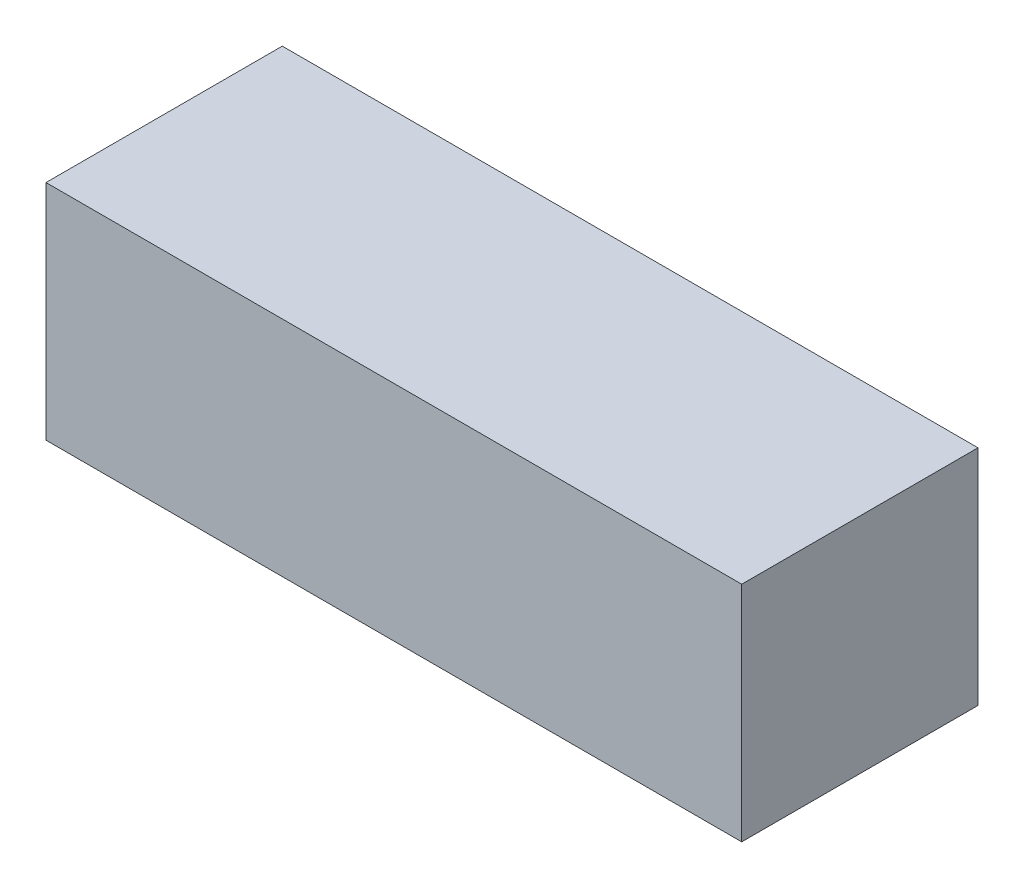
ISO-10303-21;
HEADER;
FILE_DESCRIPTION(('STEP AP214'),'2;1');
FILE_NAME('part.step','',(''),(''),'','','');
FILE_SCHEMA(('AUTOMOTIVE_DESIGN { 1 0 10303 214 1 1 1 1 }'));
ENDSEC;
DATA;
#1=APPLICATION_CONTEXT('core data for automotive mechanical design processes');
#2=APPLICATION_PROTOCOL_DEFINITION('international standard','automotive_design',2000,#1);
#3=PRODUCT_CONTEXT('',#1,'mechanical');
#4=PRODUCT('Part','Part','',(#3));
#5=PRODUCT_RELATED_PRODUCT_CATEGORY('part','',(#4));
#6=PRODUCT_DEFINITION_FORMATION('','',#4);
#7=PRODUCT_DEFINITION_CONTEXT('part definition',#1,'design');
#8=PRODUCT_DEFINITION('design','',#6,#7);
#9=PRODUCT_DEFINITION_SHAPE('','',#8);
#10=(LENGTH_UNIT() NAMED_UNIT(*) SI_UNIT(.MILLI.,.METRE.));
#11=(NAMED_UNIT(*) PLANE_ANGLE_UNIT() SI_UNIT($,.RADIAN.));
#12=(NAMED_UNIT(*) SI_UNIT($,.STERADIAN.) SOLID_ANGLE_UNIT());
#13=UNCERTAINTY_MEASURE_WITH_UNIT(LENGTH_MEASURE(1.E-05),#10,'distance_accuracy_value','');
#14=(GEOMETRIC_REPRESENTATION_CONTEXT(3) GLOBAL_UNCERTAINTY_ASSIGNED_CONTEXT((#13)) GLOBAL_UNIT_ASSIGNED_CONTEXT((#10,
#11,#12)) REPRESENTATION_CONTEXT('',''));
#15=CARTESIAN_POINT('',(0.,0.,0.));
#16=DIRECTION('',(0.,0.,1.));
#17=DIRECTION('',(1.,0.,0.));
#18=AXIS2_PLACEMENT_3D('',#15,#16,#17);
#19=CARTESIAN_POINT('',(53.,8.5,-9.));
#20=DIRECTION('',(0.,0.,1.));
#21=DIRECTION('',(1.,0.,0.));
#22=AXIS2_PLACEMENT_3D('',#19,#20,#21);
#23=PLANE('',#22);
#24=DIRECTION('',(0.,1.,0.));
#25=VECTOR('',#24,1.);
#26=CARTESIAN_POINT('',(0.,8.5,-9.));
#27=LINE('',#26,#25);
#28=CARTESIAN_POINT('',(0.,-8.5,-9.));
#29=VERTEX_POINT('',#28);
#30=CARTESIAN_POINT('',(0.,8.5,-9.));
#31=VERTEX_POINT('',#30);
#32=EDGE_CURVE('E113',#29,#31,#27,.T.);
#33=ORIENTED_EDGE('',*,*,#32,.T.);
#34=DIRECTION('',(-1.,0.,0.));
#35=VECTOR('',#34,1.);
#36=CARTESIAN_POINT('',(53.,8.5,-9.));
#37=LINE('',#36,#35);
#38=CARTESIAN_POINT('',(53.,8.5,-9.));
#39=VERTEX_POINT('',#38);
#40=EDGE_CURVE('E11',#39,#31,#37,.T.);
#41=ORIENTED_EDGE('',*,*,#40,.F.);
#42=DIRECTION('',(0.,1.,0.));
#43=VECTOR('',#42,1.);
#44=CARTESIAN_POINT('',(53.,8.5,-9.));
#45=LINE('',#44,#43);
#46=CARTESIAN_POINT('',(53.,-8.5,-9.));
#47=VERTEX_POINT('',#46);
#48=EDGE_CURVE('E97',#47,#39,#45,.T.);
#49=ORIENTED_EDGE('',*,*,#48,.F.);
#50=DIRECTION('',(-1.,0.,0.));
#51=VECTOR('',#50,1.);
#52=CARTESIAN_POINT('',(53.,-8.5,-9.));
#53=LINE('',#52,#51);
#54=EDGE_CURVE('E109',#47,#29,#53,.T.);
#55=ORIENTED_EDGE('',*,*,#54,.T.);
#56=EDGE_LOOP('',(#33,#41,#49,#55));
#57=FACE_BOUND('',#56,.T.);
#58=ADVANCED_FACE('F45',(#57),#23,.F.);
#59=CARTESIAN_POINT('',(53.,8.5,9.));
#60=DIRECTION('',(0.,-1.,0.));
#61=DIRECTION('',(0.,0.,-1.));
#62=AXIS2_PLACEMENT_3D('',#59,#60,#61);
#63=PLANE('',#62);
#64=DIRECTION('',(0.,0.,1.));
#65=VECTOR('',#64,1.);
#66=CARTESIAN_POINT('',(0.,8.5,9.));
#67=LINE('',#66,#65);
#68=CARTESIAN_POINT('',(0.,8.5,9.));
#69=VERTEX_POINT('',#68);
#70=EDGE_CURVE('E102',#31,#69,#67,.T.);
#71=ORIENTED_EDGE('',*,*,#70,.T.);
#72=DIRECTION('',(-1.,0.,0.));
#73=VECTOR('',#72,1.);
#74=CARTESIAN_POINT('',(53.,8.5,9.));
#75=LINE('',#74,#73);
#76=CARTESIAN_POINT('',(53.,8.5,9.));
#77=VERTEX_POINT('',#76);
#78=EDGE_CURVE('E54',#77,#69,#75,.T.);
#79=ORIENTED_EDGE('',*,*,#78,.F.);
#80=DIRECTION('',(0.,0.,1.));
#81=VECTOR('',#80,1.);
#82=CARTESIAN_POINT('',(53.,8.5,9.));
#83=LINE('',#82,#81);
#84=EDGE_CURVE('E92',#39,#77,#83,.T.);
#85=ORIENTED_EDGE('',*,*,#84,.F.);
#86=ORIENTED_EDGE('',*,*,#40,.T.);
#87=EDGE_LOOP('',(#71,#79,#85,#86));
#88=FACE_BOUND('',#87,.T.);
#89=ADVANCED_FACE('F101',(#88),#63,.F.);
#90=CARTESIAN_POINT('',(53.,8.5,9.));
#91=DIRECTION('',(0.,0.,-1.));
#92=DIRECTION('',(0.,1.,0.));
#93=AXIS2_PLACEMENT_3D('',#90,#91,#92);
#94=PLANE('',#93);
#95=DIRECTION('',(0.,-1.,0.));
#96=VECTOR('',#95,1.);
#97=CARTESIAN_POINT('',(0.,8.5,9.));
#98=LINE('',#97,#96);
#99=CARTESIAN_POINT('',(0.,-8.5,9.));
#100=VERTEX_POINT('',#99);
#101=EDGE_CURVE('E79',#69,#100,#98,.T.);
#102=ORIENTED_EDGE('',*,*,#101,.T.);
#103=DIRECTION('',(-1.,0.,0.));
#104=VECTOR('',#103,1.);
#105=CARTESIAN_POINT('',(53.,-8.5,9.));
#106=LINE('',#105,#104);
#107=CARTESIAN_POINT('',(53.,-8.5,9.));
#108=VERTEX_POINT('',#107);
#109=EDGE_CURVE('E104',#108,#100,#106,.T.);
#110=ORIENTED_EDGE('',*,*,#109,.F.);
#111=DIRECTION('',(0.,-1.,0.));
#112=VECTOR('',#111,1.);
#113=CARTESIAN_POINT('',(53.,8.5,9.));
#114=LINE('',#113,#112);
#115=EDGE_CURVE('E95',#77,#108,#114,.T.);
#116=ORIENTED_EDGE('',*,*,#115,.F.);
#117=ORIENTED_EDGE('',*,*,#78,.T.);
#118=EDGE_LOOP('',(#102,#110,#116,#117));
#119=FACE_BOUND('',#118,.T.);
#120=ADVANCED_FACE('F105',(#119),#94,.F.);
#121=CARTESIAN_POINT('',(53.,-8.5,9.));
#122=DIRECTION('',(0.,1.,0.));
#123=DIRECTION('',(0.,0.,1.));
#124=AXIS2_PLACEMENT_3D('',#121,#122,#123);
#125=PLANE('',#124);
#126=DIRECTION('',(0.,0.,-1.));
#127=VECTOR('',#126,1.);
#128=CARTESIAN_POINT('',(0.,-8.5,9.));
#129=LINE('',#128,#127);
#130=EDGE_CURVE('E85',#100,#29,#129,.T.);
#131=ORIENTED_EDGE('',*,*,#130,.T.);
#132=ORIENTED_EDGE('',*,*,#54,.F.);
#133=DIRECTION('',(0.,0.,-1.));
#134=VECTOR('',#133,1.);
#135=CARTESIAN_POINT('',(53.,-8.5,9.));
#136=LINE('',#135,#134);
#137=EDGE_CURVE('E62',#108,#47,#136,.T.);
#138=ORIENTED_EDGE('',*,*,#137,.F.);
#139=ORIENTED_EDGE('',*,*,#109,.T.);
#140=EDGE_LOOP('',(#131,#132,#138,#139));
#141=FACE_BOUND('',#140,.T.);
#142=ADVANCED_FACE('F126',(#141),#125,.F.);
#143=CARTESIAN_POINT('',(53.,0.,0.));
#144=DIRECTION('',(1.,0.,0.));
#145=DIRECTION('',(0.,0.,-1.));
#146=AXIS2_PLACEMENT_3D('',#143,#144,#145);
#147=PLANE('',#146);
#148=ORIENTED_EDGE('',*,*,#48,.T.);
#149=ORIENTED_EDGE('',*,*,#84,.T.);
#150=ORIENTED_EDGE('',*,*,#115,.T.);
#151=ORIENTED_EDGE('',*,*,#137,.T.);
#152=EDGE_LOOP('',(#148,#149,#150,#151));
#153=FACE_BOUND('',#152,.T.);
#154=ADVANCED_FACE('F93',(#153),#147,.T.);
#155=CARTESIAN_POINT('',(0.,0.,0.));
#156=DIRECTION('',(1.,0.,0.));
#157=DIRECTION('',(0.,0.,-1.));
#158=AXIS2_PLACEMENT_3D('',#155,#156,#157);
#159=PLANE('',#158);
#160=ORIENTED_EDGE('',*,*,#32,.F.);
#161=ORIENTED_EDGE('',*,*,#130,.F.);
#162=ORIENTED_EDGE('',*,*,#101,.F.);
#163=ORIENTED_EDGE('',*,*,#70,.F.);
#164=EDGE_LOOP('',(#160,#161,#162,#163));
#165=FACE_BOUND('',#164,.T.);
#166=ADVANCED_FACE('F129',(#165),#159,.F.);
#167=CLOSED_SHELL('',(#58,#89,#120,#142,#154,#166));
#168=MANIFOLD_SOLID_BREP('B2',#167);
#169=ADVANCED_BREP_SHAPE_REPRESENTATION('',(#18,#168),#14);
#170=SHAPE_DEFINITION_REPRESENTATION(#9,#169);
ENDSEC;
END-ISO-10303-21;
